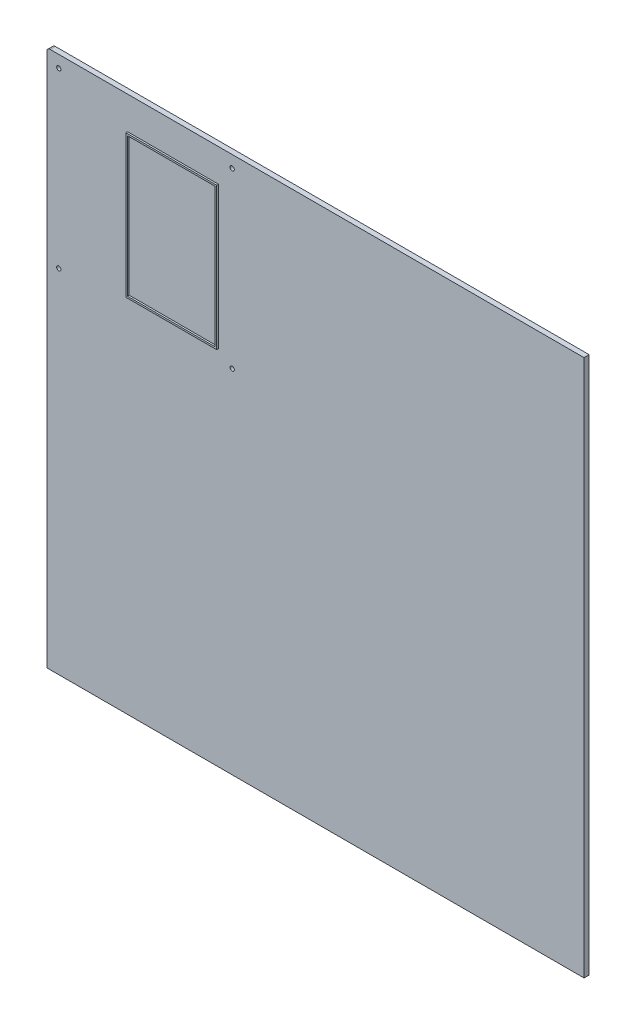
ISO-10303-21;
HEADER;
FILE_DESCRIPTION(('STEP AP214'),'2;1');
FILE_NAME('part.step','',(''),(''),'','','');
FILE_SCHEMA(('AUTOMOTIVE_DESIGN { 1 0 10303 214 1 1 1 1 }'));
ENDSEC;
DATA;
#1=APPLICATION_CONTEXT('core data for automotive mechanical design processes');
#2=APPLICATION_PROTOCOL_DEFINITION('international standard','automotive_design',2000,#1);
#3=PRODUCT_CONTEXT('',#1,'mechanical');
#4=PRODUCT('Part','Part','',(#3));
#5=PRODUCT_RELATED_PRODUCT_CATEGORY('part','',(#4));
#6=PRODUCT_DEFINITION_FORMATION('','',#4);
#7=PRODUCT_DEFINITION_CONTEXT('part definition',#1,'design');
#8=PRODUCT_DEFINITION('design','',#6,#7);
#9=PRODUCT_DEFINITION_SHAPE('','',#8);
#10=(LENGTH_UNIT() NAMED_UNIT(*) SI_UNIT(.MILLI.,.METRE.));
#11=(NAMED_UNIT(*) PLANE_ANGLE_UNIT() SI_UNIT($,.RADIAN.));
#12=(NAMED_UNIT(*) SI_UNIT($,.STERADIAN.) SOLID_ANGLE_UNIT());
#13=UNCERTAINTY_MEASURE_WITH_UNIT(LENGTH_MEASURE(1.E-05),#10,'distance_accuracy_value','');
#14=(GEOMETRIC_REPRESENTATION_CONTEXT(3) GLOBAL_UNCERTAINTY_ASSIGNED_CONTEXT((#13)) GLOBAL_UNIT_ASSIGNED_CONTEXT((#10,
#11,#12)) REPRESENTATION_CONTEXT('',''));
#15=CARTESIAN_POINT('',(0.,0.,0.));
#16=DIRECTION('',(0.,0.,1.));
#17=DIRECTION('',(1.,0.,0.));
#18=AXIS2_PLACEMENT_3D('',#15,#16,#17);
#19=CARTESIAN_POINT('',(0.,0.,6.));
#20=DIRECTION('',(0.,0.,1.));
#21=DIRECTION('',(1.,0.,0.));
#22=AXIS2_PLACEMENT_3D('',#19,#20,#21);
#23=PLANE('',#22);
#24=DIRECTION('',(0.,-1.,0.));
#25=VECTOR('',#24,1.);
#26=CARTESIAN_POINT('',(482.849420985061,111.46835443038,6.));
#27=LINE('',#26,#25);
#28=CARTESIAN_POINT('',(482.849420985061,111.46835443038,6.));
#29=VERTEX_POINT('',#28);
#30=CARTESIAN_POINT('',(482.849420985061,-514.53164556962,6.));
#31=VERTEX_POINT('',#30);
#32=EDGE_CURVE('E177',#29,#31,#27,.T.);
#33=ORIENTED_EDGE('',*,*,#32,.F.);
#34=DIRECTION('',(-1.,0.,0.));
#35=VECTOR('',#34,1.);
#36=CARTESIAN_POINT('',(-143.150579014939,111.46835443038,6.));
#37=LINE('',#36,#35);
#38=CARTESIAN_POINT('',(-139.150579014939,111.46835443038,6.));
#39=VERTEX_POINT('',#38);
#40=EDGE_CURVE('E160',#29,#39,#37,.T.);
#41=ORIENTED_EDGE('',*,*,#40,.T.);
#42=CARTESIAN_POINT('',(-139.150579014939,107.46835443038,6.));
#43=DIRECTION('',(0.,0.,1.));
#44=DIRECTION('',(1.,0.,0.));
#45=AXIS2_PLACEMENT_3D('',#42,#43,#44);
#46=CIRCLE('',#45,4.);
#47=CARTESIAN_POINT('',(-143.150579014939,107.46835443038,6.));
#48=VERTEX_POINT('',#47);
#49=EDGE_CURVE('E74',#39,#48,#46,.T.);
#50=ORIENTED_EDGE('',*,*,#49,.T.);
#51=DIRECTION('',(0.,-1.,0.));
#52=VECTOR('',#51,1.);
#53=CARTESIAN_POINT('',(-143.150579014939,111.46835443038,6.));
#54=LINE('',#53,#52);
#55=CARTESIAN_POINT('',(-143.150579014939,-514.53164556962,6.));
#56=VERTEX_POINT('',#55);
#57=EDGE_CURVE('E172',#48,#56,#54,.T.);
#58=ORIENTED_EDGE('',*,*,#57,.T.);
#59=DIRECTION('',(-1.,0.,0.));
#60=VECTOR('',#59,1.);
#61=CARTESIAN_POINT('',(482.849420985061,-514.53164556962,6.));
#62=LINE('',#61,#60);
#63=EDGE_CURVE('E182',#31,#56,#62,.T.);
#64=ORIENTED_EDGE('',*,*,#63,.F.);
#65=EDGE_LOOP('',(#33,#41,#50,#58,#64));
#66=FACE_BOUND('',#65,.T.);
#67=CARTESIAN_POINT('',(-129.150579014939,-104.53164556962,6.));
#68=DIRECTION('',(0.,0.,1.));
#69=DIRECTION('',(1.,0.,0.));
#70=AXIS2_PLACEMENT_3D('',#67,#68,#69);
#71=CIRCLE('',#70,2.5);
#72=CARTESIAN_POINT('',(-126.650579014939,-104.53164556962,6.));
#73=VERTEX_POINT('',#72);
#74=EDGE_CURVE('E287',#73,#73,#71,.T.);
#75=ORIENTED_EDGE('',*,*,#74,.F.);
#76=EDGE_LOOP('',(#75));
#77=FACE_BOUND('',#76,.T.);
#78=CARTESIAN_POINT('',(72.8494209850612,97.4683544303797,6.));
#79=DIRECTION('',(0.,0.,1.));
#80=DIRECTION('',(1.,0.,0.));
#81=AXIS2_PLACEMENT_3D('',#78,#79,#80);
#82=CIRCLE('',#81,2.5);
#83=CARTESIAN_POINT('',(75.3494209850612,97.4683544303797,6.));
#84=VERTEX_POINT('',#83);
#85=EDGE_CURVE('E303',#84,#84,#82,.T.);
#86=ORIENTED_EDGE('',*,*,#85,.F.);
#87=EDGE_LOOP('',(#86));
#88=FACE_BOUND('',#87,.T.);
#89=CARTESIAN_POINT('',(-129.150579014939,97.4683544303797,6.));
#90=DIRECTION('',(0.,0.,1.));
#91=DIRECTION('',(1.,0.,0.));
#92=AXIS2_PLACEMENT_3D('',#89,#90,#91);
#93=CIRCLE('',#92,2.5);
#94=CARTESIAN_POINT('',(-126.650579014939,97.4683544303797,6.));
#95=VERTEX_POINT('',#94);
#96=EDGE_CURVE('E311',#95,#95,#93,.T.);
#97=ORIENTED_EDGE('',*,*,#96,.F.);
#98=EDGE_LOOP('',(#97));
#99=FACE_BOUND('',#98,.T.);
#100=CARTESIAN_POINT('',(72.8494209850612,-104.53164556962,6.));
#101=DIRECTION('',(0.,0.,1.));
#102=DIRECTION('',(1.,0.,0.));
#103=AXIS2_PLACEMENT_3D('',#100,#101,#102);
#104=CIRCLE('',#103,2.5);
#105=CARTESIAN_POINT('',(75.3494209850612,-104.53164556962,6.));
#106=VERTEX_POINT('',#105);
#107=EDGE_CURVE('E295',#106,#106,#104,.T.);
#108=ORIENTED_EDGE('',*,*,#107,.F.);
#109=EDGE_LOOP('',(#108));
#110=FACE_BOUND('',#109,.T.);
#111=DIRECTION('',(0.,-1.,0.));
#112=VECTOR('',#111,1.);
#113=CARTESIAN_POINT('',(56.8494209850612,73.4683544303797,6.));
#114=LINE('',#113,#112);
#115=CARTESIAN_POINT('',(56.8494209850612,73.4683544303797,6.));
#116=VERTEX_POINT('',#115);
#117=CARTESIAN_POINT('',(56.8494209850612,-92.5316455696203,6.));
#118=VERTEX_POINT('',#117);
#119=EDGE_CURVE('E266',#116,#118,#114,.T.);
#120=ORIENTED_EDGE('',*,*,#119,.T.);
#121=DIRECTION('',(1.,0.,0.));
#122=VECTOR('',#121,1.);
#123=CARTESIAN_POINT('',(-49.1505790149388,-92.5316455696203,6.));
#124=LINE('',#123,#122);
#125=CARTESIAN_POINT('',(-49.1505790149388,-92.5316455696203,6.));
#126=VERTEX_POINT('',#125);
#127=EDGE_CURVE('E246',#126,#118,#124,.T.);
#128=ORIENTED_EDGE('',*,*,#127,.F.);
#129=DIRECTION('',(0.,-1.,0.));
#130=VECTOR('',#129,1.);
#131=CARTESIAN_POINT('',(-49.1505790149388,73.4683544303797,6.));
#132=LINE('',#131,#130);
#133=CARTESIAN_POINT('',(-49.1505790149388,73.4683544303797,6.));
#134=VERTEX_POINT('',#133);
#135=EDGE_CURVE('E251',#134,#126,#132,.T.);
#136=ORIENTED_EDGE('',*,*,#135,.F.);
#137=DIRECTION('',(1.,0.,0.));
#138=VECTOR('',#137,1.);
#139=CARTESIAN_POINT('',(-49.1505790149388,73.4683544303797,6.));
#140=LINE('',#139,#138);
#141=EDGE_CURVE('E81',#134,#116,#140,.T.);
#142=ORIENTED_EDGE('',*,*,#141,.T.);
#143=EDGE_LOOP('',(#120,#128,#136,#142));
#144=FACE_BOUND('',#143,.T.);
#145=ADVANCED_FACE('F65',(#66,#77,#88,#99,#110,#144),#23,.T.);
#146=CARTESIAN_POINT('',(0.,0.,0.));
#147=DIRECTION('',(0.,0.,1.));
#148=DIRECTION('',(1.,0.,0.));
#149=AXIS2_PLACEMENT_3D('',#146,#147,#148);
#150=PLANE('',#149);
#151=DIRECTION('',(-1.,0.,0.));
#152=VECTOR('',#151,1.);
#153=CARTESIAN_POINT('',(-143.150579014939,111.46835443038,0.));
#154=LINE('',#153,#152);
#155=CARTESIAN_POINT('',(482.849420985061,111.46835443038,0.));
#156=VERTEX_POINT('',#155);
#157=CARTESIAN_POINT('',(-139.150579014939,111.46835443038,0.));
#158=VERTEX_POINT('',#157);
#159=EDGE_CURVE('E320',#156,#158,#154,.T.);
#160=ORIENTED_EDGE('',*,*,#159,.F.);
#161=DIRECTION('',(0.,-1.,0.));
#162=VECTOR('',#161,1.);
#163=CARTESIAN_POINT('',(482.849420985061,111.46835443038,0.));
#164=LINE('',#163,#162);
#165=CARTESIAN_POINT('',(482.849420985061,-514.53164556962,0.));
#166=VERTEX_POINT('',#165);
#167=EDGE_CURVE('E179',#156,#166,#164,.T.);
#168=ORIENTED_EDGE('',*,*,#167,.T.);
#169=DIRECTION('',(-1.,0.,0.));
#170=VECTOR('',#169,1.);
#171=CARTESIAN_POINT('',(482.849420985061,-514.53164556962,0.));
#172=LINE('',#171,#170);
#173=CARTESIAN_POINT('',(-143.150579014939,-514.53164556962,0.));
#174=VERTEX_POINT('',#173);
#175=EDGE_CURVE('E188',#166,#174,#172,.T.);
#176=ORIENTED_EDGE('',*,*,#175,.T.);
#177=DIRECTION('',(0.,-1.,0.));
#178=VECTOR('',#177,1.);
#179=CARTESIAN_POINT('',(-143.150579014939,111.46835443038,0.));
#180=LINE('',#179,#178);
#181=CARTESIAN_POINT('',(-143.150579014939,107.46835443038,0.));
#182=VERTEX_POINT('',#181);
#183=EDGE_CURVE('E315',#182,#174,#180,.T.);
#184=ORIENTED_EDGE('',*,*,#183,.F.);
#185=CARTESIAN_POINT('',(-139.150579014939,107.46835443038,0.));
#186=DIRECTION('',(0.,0.,1.));
#187=DIRECTION('',(1.,0.,0.));
#188=AXIS2_PLACEMENT_3D('',#185,#186,#187);
#189=CIRCLE('',#188,4.);
#190=EDGE_CURVE('E171',#182,#158,#189,.F.);
#191=ORIENTED_EDGE('',*,*,#190,.T.);
#192=EDGE_LOOP('',(#160,#168,#176,#184,#191));
#193=FACE_BOUND('',#192,.T.);
#194=CARTESIAN_POINT('',(-129.150579014939,97.4683544303797,0.));
#195=DIRECTION('',(0.,0.,1.));
#196=DIRECTION('',(1.,0.,0.));
#197=AXIS2_PLACEMENT_3D('',#194,#195,#196);
#198=CIRCLE('',#197,2.5);
#199=CARTESIAN_POINT('',(-126.650579014939,97.4683544303797,0.));
#200=VERTEX_POINT('',#199);
#201=EDGE_CURVE('E307',#200,#200,#198,.T.);
#202=ORIENTED_EDGE('',*,*,#201,.T.);
#203=EDGE_LOOP('',(#202));
#204=FACE_BOUND('',#203,.T.);
#205=CARTESIAN_POINT('',(72.8494209850612,97.4683544303797,0.));
#206=DIRECTION('',(0.,0.,1.));
#207=DIRECTION('',(1.,0.,0.));
#208=AXIS2_PLACEMENT_3D('',#205,#206,#207);
#209=CIRCLE('',#208,2.5);
#210=CARTESIAN_POINT('',(75.3494209850612,97.4683544303797,0.));
#211=VERTEX_POINT('',#210);
#212=EDGE_CURVE('E299',#211,#211,#209,.T.);
#213=ORIENTED_EDGE('',*,*,#212,.T.);
#214=EDGE_LOOP('',(#213));
#215=FACE_BOUND('',#214,.T.);
#216=CARTESIAN_POINT('',(72.8494209850612,-104.53164556962,0.));
#217=DIRECTION('',(0.,0.,1.));
#218=DIRECTION('',(1.,0.,0.));
#219=AXIS2_PLACEMENT_3D('',#216,#217,#218);
#220=CIRCLE('',#219,2.5);
#221=CARTESIAN_POINT('',(75.3494209850612,-104.53164556962,0.));
#222=VERTEX_POINT('',#221);
#223=EDGE_CURVE('E291',#222,#222,#220,.T.);
#224=ORIENTED_EDGE('',*,*,#223,.T.);
#225=EDGE_LOOP('',(#224));
#226=FACE_BOUND('',#225,.T.);
#227=CARTESIAN_POINT('',(-129.150579014939,-104.53164556962,0.));
#228=DIRECTION('',(0.,0.,1.));
#229=DIRECTION('',(1.,0.,0.));
#230=AXIS2_PLACEMENT_3D('',#227,#228,#229);
#231=CIRCLE('',#230,2.5);
#232=CARTESIAN_POINT('',(-126.650579014939,-104.53164556962,0.));
#233=VERTEX_POINT('',#232);
#234=EDGE_CURVE('E286',#233,#233,#231,.T.);
#235=ORIENTED_EDGE('',*,*,#234,.T.);
#236=EDGE_LOOP('',(#235));
#237=FACE_BOUND('',#236,.T.);
#238=ADVANCED_FACE('F340',(#193,#204,#215,#226,#237),#150,.F.);
#239=CARTESIAN_POINT('',(-143.150579014939,111.46835443038,6.));
#240=DIRECTION('',(1.,0.,0.));
#241=DIRECTION('',(0.,0.,-1.));
#242=AXIS2_PLACEMENT_3D('',#239,#240,#241);
#243=PLANE('',#242);
#244=ORIENTED_EDGE('',*,*,#183,.T.);
#245=DIRECTION('',(0.,0.,-1.));
#246=VECTOR('',#245,1.);
#247=CARTESIAN_POINT('',(-143.150579014939,-514.53164556962,6.));
#248=LINE('',#247,#246);
#249=EDGE_CURVE('E198',#56,#174,#248,.T.);
#250=ORIENTED_EDGE('',*,*,#249,.F.);
#251=ORIENTED_EDGE('',*,*,#57,.F.);
#252=DIRECTION('',(0.,0.,-1.));
#253=VECTOR('',#252,1.);
#254=CARTESIAN_POINT('',(-143.150579014939,107.46835443038,6.));
#255=LINE('',#254,#253);
#256=EDGE_CURVE('E328',#48,#182,#255,.T.);
#257=ORIENTED_EDGE('',*,*,#256,.T.);
#258=EDGE_LOOP('',(#244,#250,#251,#257));
#259=FACE_BOUND('',#258,.T.);
#260=ADVANCED_FACE('F337',(#259),#243,.F.);
#261=CARTESIAN_POINT('',(-143.150579014939,111.46835443038,6.));
#262=DIRECTION('',(0.,-1.,0.));
#263=DIRECTION('',(1.,0.,0.));
#264=AXIS2_PLACEMENT_3D('',#261,#262,#263);
#265=PLANE('',#264);
#266=ORIENTED_EDGE('',*,*,#159,.T.);
#267=DIRECTION('',(0.,0.,-1.));
#268=VECTOR('',#267,1.);
#269=CARTESIAN_POINT('',(-139.150579014939,111.46835443038,6.));
#270=LINE('',#269,#268);
#271=EDGE_CURVE('E12',#158,#39,#270,.F.);
#272=ORIENTED_EDGE('',*,*,#271,.T.);
#273=ORIENTED_EDGE('',*,*,#40,.F.);
#274=DIRECTION('',(0.,0.,-1.));
#275=VECTOR('',#274,1.);
#276=CARTESIAN_POINT('',(482.849420985061,111.46835443038,6.));
#277=LINE('',#276,#275);
#278=EDGE_CURVE('E164',#29,#156,#277,.T.);
#279=ORIENTED_EDGE('',*,*,#278,.T.);
#280=EDGE_LOOP('',(#266,#272,#273,#279));
#281=FACE_BOUND('',#280,.T.);
#282=ADVANCED_FACE('F163',(#281),#265,.F.);
#283=CARTESIAN_POINT('',(-129.150579014939,97.4683544303797,6.));
#284=DIRECTION('',(0.,0.,-1.));
#285=DIRECTION('',(-1.,0.,0.));
#286=AXIS2_PLACEMENT_3D('',#283,#284,#285);
#287=CYLINDRICAL_SURFACE('',#286,2.5);
#288=ORIENTED_EDGE('',*,*,#96,.T.);
#289=EDGE_LOOP('',(#288));
#290=FACE_BOUND('',#289,.T.);
#291=ORIENTED_EDGE('',*,*,#201,.F.);
#292=EDGE_LOOP('',(#291));
#293=FACE_BOUND('',#292,.T.);
#294=ADVANCED_FACE('F361',(#290,#293),#287,.F.);
#295=CARTESIAN_POINT('',(72.8494209850612,97.4683544303797,6.));
#296=DIRECTION('',(0.,0.,-1.));
#297=DIRECTION('',(-1.,0.,0.));
#298=AXIS2_PLACEMENT_3D('',#295,#296,#297);
#299=CYLINDRICAL_SURFACE('',#298,2.5);
#300=ORIENTED_EDGE('',*,*,#85,.T.);
#301=EDGE_LOOP('',(#300));
#302=FACE_BOUND('',#301,.T.);
#303=ORIENTED_EDGE('',*,*,#212,.F.);
#304=EDGE_LOOP('',(#303));
#305=FACE_BOUND('',#304,.T.);
#306=ADVANCED_FACE('F380',(#302,#305),#299,.F.);
#307=CARTESIAN_POINT('',(72.8494209850612,-104.53164556962,6.));
#308=DIRECTION('',(0.,0.,-1.));
#309=DIRECTION('',(-1.,0.,0.));
#310=AXIS2_PLACEMENT_3D('',#307,#308,#309);
#311=CYLINDRICAL_SURFACE('',#310,2.5);
#312=ORIENTED_EDGE('',*,*,#107,.T.);
#313=EDGE_LOOP('',(#312));
#314=FACE_BOUND('',#313,.T.);
#315=ORIENTED_EDGE('',*,*,#223,.F.);
#316=EDGE_LOOP('',(#315));
#317=FACE_BOUND('',#316,.T.);
#318=ADVANCED_FACE('F387',(#314,#317),#311,.F.);
#319=CARTESIAN_POINT('',(-129.150579014939,-104.53164556962,6.));
#320=DIRECTION('',(0.,0.,-1.));
#321=DIRECTION('',(-1.,0.,0.));
#322=AXIS2_PLACEMENT_3D('',#319,#320,#321);
#323=CYLINDRICAL_SURFACE('',#322,2.5);
#324=ORIENTED_EDGE('',*,*,#74,.T.);
#325=EDGE_LOOP('',(#324));
#326=FACE_BOUND('',#325,.T.);
#327=ORIENTED_EDGE('',*,*,#234,.F.);
#328=EDGE_LOOP('',(#327));
#329=FACE_BOUND('',#328,.T.);
#330=ADVANCED_FACE('F394',(#326,#329),#323,.F.);
#331=CARTESIAN_POINT('',(-139.150579014939,107.46835443038,6.));
#332=DIRECTION('',(0.,0.,-1.));
#333=DIRECTION('',(-1.,0.,0.));
#334=AXIS2_PLACEMENT_3D('',#331,#332,#333);
#335=CYLINDRICAL_SURFACE('',#334,4.);
#336=ORIENTED_EDGE('',*,*,#49,.F.);
#337=ORIENTED_EDGE('',*,*,#271,.F.);
#338=ORIENTED_EDGE('',*,*,#190,.F.);
#339=ORIENTED_EDGE('',*,*,#256,.F.);
#340=EDGE_LOOP('',(#336,#337,#338,#339));
#341=FACE_BOUND('',#340,.T.);
#342=ADVANCED_FACE('F67',(#341),#335,.T.);
#343=CARTESIAN_POINT('',(0.,0.,8.));
#344=DIRECTION('',(0.,0.,-1.));
#345=DIRECTION('',(-1.,0.,0.));
#346=AXIS2_PLACEMENT_3D('',#343,#344,#345);
#347=PLANE('',#346);
#348=DIRECTION('',(1.,0.,0.));
#349=VECTOR('',#348,1.);
#350=CARTESIAN_POINT('',(-49.1505790149388,-92.5316455696203,8.));
#351=LINE('',#350,#349);
#352=CARTESIAN_POINT('',(-49.1505790149388,-92.5316455696203,8.));
#353=VERTEX_POINT('',#352);
#354=CARTESIAN_POINT('',(56.8494209850612,-92.5316455696203,8.));
#355=VERTEX_POINT('',#354);
#356=EDGE_CURVE('E247',#353,#355,#351,.T.);
#357=ORIENTED_EDGE('',*,*,#356,.T.);
#358=DIRECTION('',(0.,-1.,0.));
#359=VECTOR('',#358,1.);
#360=CARTESIAN_POINT('',(56.8494209850612,73.4683544303797,8.));
#361=LINE('',#360,#359);
#362=CARTESIAN_POINT('',(56.8494209850612,73.4683544303797,8.));
#363=VERTEX_POINT('',#362);
#364=EDGE_CURVE('E250',#363,#355,#361,.T.);
#365=ORIENTED_EDGE('',*,*,#364,.F.);
#366=DIRECTION('',(1.,0.,0.));
#367=VECTOR('',#366,1.);
#368=CARTESIAN_POINT('',(-49.1505790149388,73.4683544303797,8.));
#369=LINE('',#368,#367);
#370=CARTESIAN_POINT('',(-49.1505790149388,73.4683544303797,8.));
#371=VERTEX_POINT('',#370);
#372=EDGE_CURVE('E255',#371,#363,#369,.T.);
#373=ORIENTED_EDGE('',*,*,#372,.F.);
#374=DIRECTION('',(0.,-1.,0.));
#375=VECTOR('',#374,1.);
#376=CARTESIAN_POINT('',(-49.1505790149388,73.4683544303797,8.));
#377=LINE('',#376,#375);
#378=EDGE_CURVE('E259',#371,#353,#377,.T.);
#379=ORIENTED_EDGE('',*,*,#378,.T.);
#380=EDGE_LOOP('',(#357,#365,#373,#379));
#381=FACE_BOUND('',#380,.T.);
#382=DIRECTION('',(1.,0.,0.));
#383=VECTOR('',#382,1.);
#384=CARTESIAN_POINT('',(-47.1505790149388,-90.5316455696203,8.));
#385=LINE('',#384,#383);
#386=CARTESIAN_POINT('',(-47.1505790149388,-90.5316455696203,8.));
#387=VERTEX_POINT('',#386);
#388=CARTESIAN_POINT('',(54.8494209850612,-90.5316455696203,8.));
#389=VERTEX_POINT('',#388);
#390=EDGE_CURVE('E204',#387,#389,#385,.T.);
#391=ORIENTED_EDGE('',*,*,#390,.F.);
#392=DIRECTION('',(0.,-1.,0.));
#393=VECTOR('',#392,1.);
#394=CARTESIAN_POINT('',(-47.1505790149388,71.4683544303797,8.));
#395=LINE('',#394,#393);
#396=CARTESIAN_POINT('',(-47.1505790149388,71.4683544303797,8.));
#397=VERTEX_POINT('',#396);
#398=EDGE_CURVE('E216',#397,#387,#395,.T.);
#399=ORIENTED_EDGE('',*,*,#398,.F.);
#400=DIRECTION('',(1.,0.,0.));
#401=VECTOR('',#400,1.);
#402=CARTESIAN_POINT('',(-47.1505790149388,71.4683544303797,8.));
#403=LINE('',#402,#401);
#404=CARTESIAN_POINT('',(54.8494209850612,71.4683544303797,8.));
#405=VERTEX_POINT('',#404);
#406=EDGE_CURVE('E212',#397,#405,#403,.T.);
#407=ORIENTED_EDGE('',*,*,#406,.T.);
#408=DIRECTION('',(0.,-1.,0.));
#409=VECTOR('',#408,1.);
#410=CARTESIAN_POINT('',(54.8494209850612,71.4683544303797,8.));
#411=LINE('',#410,#409);
#412=EDGE_CURVE('E207',#405,#389,#411,.T.);
#413=ORIENTED_EDGE('',*,*,#412,.T.);
#414=EDGE_LOOP('',(#391,#399,#407,#413));
#415=FACE_BOUND('',#414,.T.);
#416=ADVANCED_FACE('F409',(#381,#415),#347,.F.);
#417=CARTESIAN_POINT('',(-49.1505790149388,-92.5316455696203,8.));
#418=DIRECTION('',(0.,1.,0.));
#419=DIRECTION('',(0.,0.,1.));
#420=AXIS2_PLACEMENT_3D('',#417,#418,#419);
#421=PLANE('',#420);
#422=ORIENTED_EDGE('',*,*,#127,.T.);
#423=DIRECTION('',(0.,0.,-1.));
#424=VECTOR('',#423,1.);
#425=CARTESIAN_POINT('',(56.8494209850612,-92.5316455696203,8.));
#426=LINE('',#425,#424);
#427=EDGE_CURVE('E283',#355,#118,#426,.T.);
#428=ORIENTED_EDGE('',*,*,#427,.F.);
#429=ORIENTED_EDGE('',*,*,#356,.F.);
#430=DIRECTION('',(0.,0.,-1.));
#431=VECTOR('',#430,1.);
#432=CARTESIAN_POINT('',(-49.1505790149388,-92.5316455696203,8.));
#433=LINE('',#432,#431);
#434=EDGE_CURVE('E262',#353,#126,#433,.T.);
#435=ORIENTED_EDGE('',*,*,#434,.T.);
#436=EDGE_LOOP('',(#422,#428,#429,#435));
#437=FACE_BOUND('',#436,.T.);
#438=ADVANCED_FACE('F415',(#437),#421,.F.);
#439=CARTESIAN_POINT('',(56.8494209850612,73.4683544303797,8.));
#440=DIRECTION('',(1.,0.,0.));
#441=DIRECTION('',(0.,1.,0.));
#442=AXIS2_PLACEMENT_3D('',#439,#440,#441);
#443=PLANE('',#442);
#444=ORIENTED_EDGE('',*,*,#119,.F.);
#445=DIRECTION('',(0.,0.,-1.));
#446=VECTOR('',#445,1.);
#447=CARTESIAN_POINT('',(56.8494209850612,73.4683544303797,8.));
#448=LINE('',#447,#446);
#449=EDGE_CURVE('E280',#363,#116,#448,.T.);
#450=ORIENTED_EDGE('',*,*,#449,.F.);
#451=ORIENTED_EDGE('',*,*,#364,.T.);
#452=ORIENTED_EDGE('',*,*,#427,.T.);
#453=EDGE_LOOP('',(#444,#450,#451,#452));
#454=FACE_BOUND('',#453,.T.);
#455=ADVANCED_FACE('F423',(#454),#443,.T.);
#456=CARTESIAN_POINT('',(-49.1505790149388,73.4683544303797,8.));
#457=DIRECTION('',(0.,1.,0.));
#458=DIRECTION('',(0.,0.,1.));
#459=AXIS2_PLACEMENT_3D('',#456,#457,#458);
#460=PLANE('',#459);
#461=ORIENTED_EDGE('',*,*,#141,.F.);
#462=DIRECTION('',(0.,0.,-1.));
#463=VECTOR('',#462,1.);
#464=CARTESIAN_POINT('',(-49.1505790149388,73.4683544303797,8.));
#465=LINE('',#464,#463);
#466=EDGE_CURVE('E277',#371,#134,#465,.T.);
#467=ORIENTED_EDGE('',*,*,#466,.F.);
#468=ORIENTED_EDGE('',*,*,#372,.T.);
#469=ORIENTED_EDGE('',*,*,#449,.T.);
#470=EDGE_LOOP('',(#461,#467,#468,#469));
#471=FACE_BOUND('',#470,.T.);
#472=ADVANCED_FACE('F431',(#471),#460,.T.);
#473=CARTESIAN_POINT('',(-49.1505790149388,73.4683544303797,8.));
#474=DIRECTION('',(1.,0.,0.));
#475=DIRECTION('',(0.,1.,0.));
#476=AXIS2_PLACEMENT_3D('',#473,#474,#475);
#477=PLANE('',#476);
#478=ORIENTED_EDGE('',*,*,#135,.T.);
#479=ORIENTED_EDGE('',*,*,#434,.F.);
#480=ORIENTED_EDGE('',*,*,#378,.F.);
#481=ORIENTED_EDGE('',*,*,#466,.T.);
#482=EDGE_LOOP('',(#478,#479,#480,#481));
#483=FACE_BOUND('',#482,.T.);
#484=ADVANCED_FACE('F439',(#483),#477,.F.);
#485=CARTESIAN_POINT('',(-47.1505790149388,-90.5316455696203,8.));
#486=DIRECTION('',(0.,1.,0.));
#487=DIRECTION('',(0.,0.,1.));
#488=AXIS2_PLACEMENT_3D('',#485,#486,#487);
#489=PLANE('',#488);
#490=DIRECTION('',(1.,0.,0.));
#491=VECTOR('',#490,1.);
#492=CARTESIAN_POINT('',(-47.1505790149388,-90.5316455696203,6.));
#493=LINE('',#492,#491);
#494=CARTESIAN_POINT('',(-47.1505790149388,-90.5316455696203,6.));
#495=VERTEX_POINT('',#494);
#496=CARTESIAN_POINT('',(54.8494209850612,-90.5316455696203,6.));
#497=VERTEX_POINT('',#496);
#498=EDGE_CURVE('E89',#495,#497,#493,.T.);
#499=ORIENTED_EDGE('',*,*,#498,.F.);
#500=DIRECTION('',(0.,0.,-1.));
#501=VECTOR('',#500,1.);
#502=CARTESIAN_POINT('',(-47.1505790149388,-90.5316455696203,8.));
#503=LINE('',#502,#501);
#504=EDGE_CURVE('E219',#387,#495,#503,.T.);
#505=ORIENTED_EDGE('',*,*,#504,.F.);
#506=ORIENTED_EDGE('',*,*,#390,.T.);
#507=DIRECTION('',(0.,0.,-1.));
#508=VECTOR('',#507,1.);
#509=CARTESIAN_POINT('',(54.8494209850612,-90.5316455696203,8.));
#510=LINE('',#509,#508);
#511=EDGE_CURVE('E243',#389,#497,#510,.T.);
#512=ORIENTED_EDGE('',*,*,#511,.T.);
#513=EDGE_LOOP('',(#499,#505,#506,#512));
#514=FACE_BOUND('',#513,.T.);
#515=ADVANCED_FACE('F446',(#514),#489,.T.);
#516=CARTESIAN_POINT('',(54.8494209850612,71.4683544303797,8.));
#517=DIRECTION('',(1.,0.,0.));
#518=DIRECTION('',(0.,1.,0.));
#519=AXIS2_PLACEMENT_3D('',#516,#517,#518);
#520=PLANE('',#519);
#521=DIRECTION('',(0.,-1.,0.));
#522=VECTOR('',#521,1.);
#523=CARTESIAN_POINT('',(54.8494209850612,71.4683544303797,6.));
#524=LINE('',#523,#522);
#525=CARTESIAN_POINT('',(54.8494209850612,71.4683544303797,6.));
#526=VERTEX_POINT('',#525);
#527=EDGE_CURVE('E222',#526,#497,#524,.T.);
#528=ORIENTED_EDGE('',*,*,#527,.T.);
#529=ORIENTED_EDGE('',*,*,#511,.F.);
#530=ORIENTED_EDGE('',*,*,#412,.F.);
#531=DIRECTION('',(0.,0.,-1.));
#532=VECTOR('',#531,1.);
#533=CARTESIAN_POINT('',(54.8494209850612,71.4683544303797,8.));
#534=LINE('',#533,#532);
#535=EDGE_CURVE('E239',#405,#526,#534,.T.);
#536=ORIENTED_EDGE('',*,*,#535,.T.);
#537=EDGE_LOOP('',(#528,#529,#530,#536));
#538=FACE_BOUND('',#537,.T.);
#539=ADVANCED_FACE('F454',(#538),#520,.F.);
#540=CARTESIAN_POINT('',(-47.1505790149388,71.4683544303797,8.));
#541=DIRECTION('',(0.,1.,0.));
#542=DIRECTION('',(0.,0.,1.));
#543=AXIS2_PLACEMENT_3D('',#540,#541,#542);
#544=PLANE('',#543);
#545=DIRECTION('',(1.,0.,0.));
#546=VECTOR('',#545,1.);
#547=CARTESIAN_POINT('',(-47.1505790149388,71.4683544303797,6.));
#548=LINE('',#547,#546);
#549=CARTESIAN_POINT('',(-47.1505790149388,71.4683544303797,6.));
#550=VERTEX_POINT('',#549);
#551=EDGE_CURVE('E226',#550,#526,#548,.T.);
#552=ORIENTED_EDGE('',*,*,#551,.T.);
#553=ORIENTED_EDGE('',*,*,#535,.F.);
#554=ORIENTED_EDGE('',*,*,#406,.F.);
#555=DIRECTION('',(0.,0.,-1.));
#556=VECTOR('',#555,1.);
#557=CARTESIAN_POINT('',(-47.1505790149388,71.4683544303797,8.));
#558=LINE('',#557,#556);
#559=EDGE_CURVE('E235',#397,#550,#558,.T.);
#560=ORIENTED_EDGE('',*,*,#559,.T.);
#561=EDGE_LOOP('',(#552,#553,#554,#560));
#562=FACE_BOUND('',#561,.T.);
#563=ADVANCED_FACE('F462',(#562),#544,.F.);
#564=CARTESIAN_POINT('',(-47.1505790149388,71.4683544303797,8.));
#565=DIRECTION('',(1.,0.,0.));
#566=DIRECTION('',(0.,1.,0.));
#567=AXIS2_PLACEMENT_3D('',#564,#565,#566);
#568=PLANE('',#567);
#569=DIRECTION('',(0.,-1.,0.));
#570=VECTOR('',#569,1.);
#571=CARTESIAN_POINT('',(-47.1505790149388,71.4683544303797,6.));
#572=LINE('',#571,#570);
#573=EDGE_CURVE('E208',#550,#495,#572,.T.);
#574=ORIENTED_EDGE('',*,*,#573,.F.);
#575=ORIENTED_EDGE('',*,*,#559,.F.);
#576=ORIENTED_EDGE('',*,*,#398,.T.);
#577=ORIENTED_EDGE('',*,*,#504,.T.);
#578=EDGE_LOOP('',(#574,#575,#576,#577));
#579=FACE_BOUND('',#578,.T.);
#580=ADVANCED_FACE('F353',(#579),#568,.T.);
#581=ORIENTED_EDGE('',*,*,#498,.T.);
#582=ORIENTED_EDGE('',*,*,#527,.F.);
#583=ORIENTED_EDGE('',*,*,#551,.F.);
#584=ORIENTED_EDGE('',*,*,#573,.T.);
#585=EDGE_LOOP('',(#581,#582,#583,#584));
#586=FACE_BOUND('',#585,.T.);
#587=ADVANCED_FACE('F346',(#586),#23,.T.);
#588=CARTESIAN_POINT('',(482.849420985061,-514.53164556962,6.));
#589=DIRECTION('',(0.,-1.,0.));
#590=DIRECTION('',(0.,0.,-1.));
#591=AXIS2_PLACEMENT_3D('',#588,#589,#590);
#592=PLANE('',#591);
#593=ORIENTED_EDGE('',*,*,#175,.F.);
#594=DIRECTION('',(0.,0.,-1.));
#595=VECTOR('',#594,1.);
#596=CARTESIAN_POINT('',(482.849420985061,-514.53164556962,6.));
#597=LINE('',#596,#595);
#598=EDGE_CURVE('E181',#31,#166,#597,.T.);
#599=ORIENTED_EDGE('',*,*,#598,.F.);
#600=ORIENTED_EDGE('',*,*,#63,.T.);
#601=ORIENTED_EDGE('',*,*,#249,.T.);
#602=EDGE_LOOP('',(#593,#599,#600,#601));
#603=FACE_BOUND('',#602,.T.);
#604=ADVANCED_FACE('F344',(#603),#592,.T.);
#605=CARTESIAN_POINT('',(482.849420985061,111.46835443038,6.));
#606=DIRECTION('',(1.,0.,0.));
#607=DIRECTION('',(0.,1.,0.));
#608=AXIS2_PLACEMENT_3D('',#605,#606,#607);
#609=PLANE('',#608);
#610=ORIENTED_EDGE('',*,*,#167,.F.);
#611=ORIENTED_EDGE('',*,*,#278,.F.);
#612=ORIENTED_EDGE('',*,*,#32,.T.);
#613=ORIENTED_EDGE('',*,*,#598,.T.);
#614=EDGE_LOOP('',(#610,#611,#612,#613));
#615=FACE_BOUND('',#614,.T.);
#616=ADVANCED_FACE('F176',(#615),#609,.T.);
#617=CLOSED_SHELL('',(#145,#238,#260,#282,#294,#306,#318,#330,#342,#416,#438,#455,#472,#484,
#515,#539,#563,#580,#587,#604,#616));
#618=MANIFOLD_SOLID_BREP('B2',#617);
#619=ADVANCED_BREP_SHAPE_REPRESENTATION('',(#18,#618),#14);
#620=SHAPE_DEFINITION_REPRESENTATION(#9,#619);
ENDSEC;
END-ISO-10303-21;
